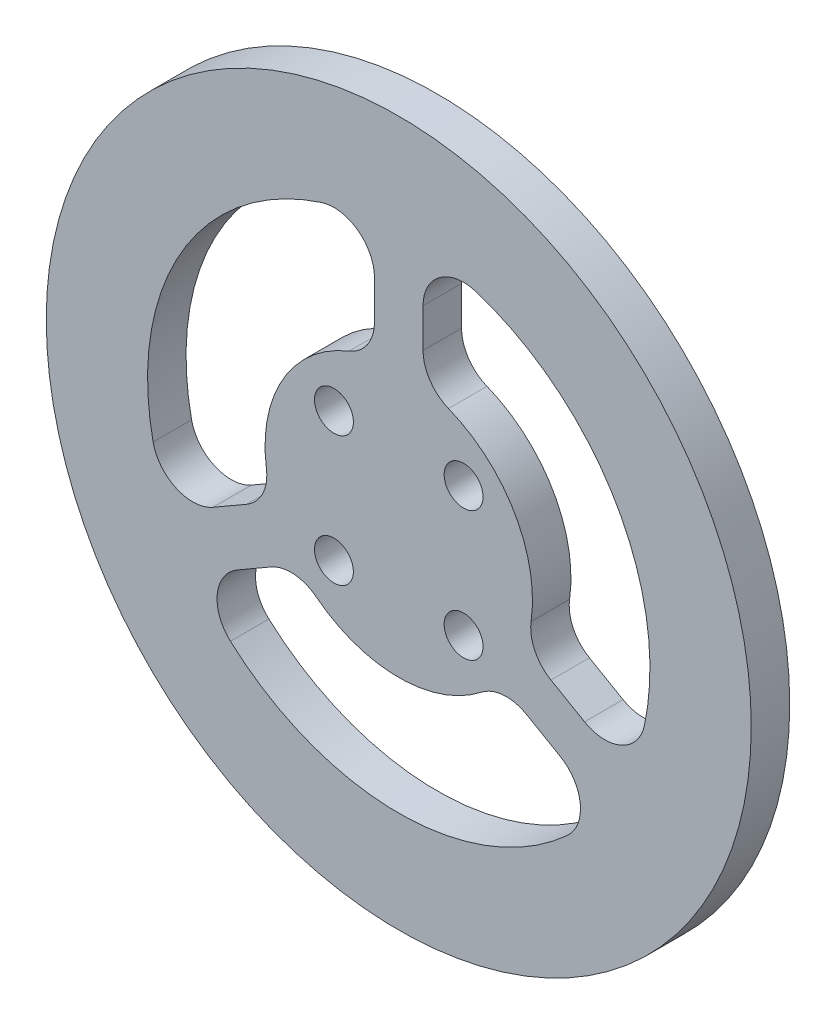
ISO-10303-21;
HEADER;
FILE_DESCRIPTION(('STEP AP214'),'2;1');
FILE_NAME('part.step','',(''),(''),'','','');
FILE_SCHEMA(('AUTOMOTIVE_DESIGN { 1 0 10303 214 1 1 1 1 }'));
ENDSEC;
DATA;
#1=APPLICATION_CONTEXT('core data for automotive mechanical design processes');
#2=APPLICATION_PROTOCOL_DEFINITION('international standard','automotive_design',2000,#1);
#3=PRODUCT_CONTEXT('',#1,'mechanical');
#4=PRODUCT('Part','Part','',(#3));
#5=PRODUCT_RELATED_PRODUCT_CATEGORY('part','',(#4));
#6=PRODUCT_DEFINITION_FORMATION('','',#4);
#7=PRODUCT_DEFINITION_CONTEXT('part definition',#1,'design');
#8=PRODUCT_DEFINITION('design','',#6,#7);
#9=PRODUCT_DEFINITION_SHAPE('','',#8);
#10=(LENGTH_UNIT() NAMED_UNIT(*) SI_UNIT(.MILLI.,.METRE.));
#11=(NAMED_UNIT(*) PLANE_ANGLE_UNIT() SI_UNIT($,.RADIAN.));
#12=(NAMED_UNIT(*) SI_UNIT($,.STERADIAN.) SOLID_ANGLE_UNIT());
#13=UNCERTAINTY_MEASURE_WITH_UNIT(LENGTH_MEASURE(1.E-05),#10,'distance_accuracy_value','');
#14=(GEOMETRIC_REPRESENTATION_CONTEXT(3) GLOBAL_UNCERTAINTY_ASSIGNED_CONTEXT((#13)) GLOBAL_UNIT_ASSIGNED_CONTEXT((#10,
#11,#12)) REPRESENTATION_CONTEXT('',''));
#15=CARTESIAN_POINT('',(0.,0.,0.));
#16=DIRECTION('',(0.,0.,1.));
#17=DIRECTION('',(1.,0.,0.));
#18=AXIS2_PLACEMENT_3D('',#15,#16,#17);
#19=CARTESIAN_POINT('',(0.,0.,-16.9802));
#20=DIRECTION('',(0.,0.,1.));
#21=DIRECTION('',(1.,0.,0.));
#22=AXIS2_PLACEMENT_3D('',#19,#20,#21);
#23=CYLINDRICAL_SURFACE('',#22,31.);
#24=CARTESIAN_POINT('',(0.,0.,0.));
#25=DIRECTION('',(0.,0.,1.));
#26=DIRECTION('',(1.,0.,0.));
#27=AXIS2_PLACEMENT_3D('',#24,#25,#26);
#28=CIRCLE('',#27,31.);
#29=CARTESIAN_POINT('',(30.3135709174803,-6.4874816555344,0.));
#30=VERTEX_POINT('',#29);
#31=CARTESIAN_POINT('',(9.53846153846153,29.4960633217263,0.));
#32=VERTEX_POINT('',#31);
#33=EDGE_CURVE('E215',#30,#32,#28,.T.);
#34=ORIENTED_EDGE('',*,*,#33,.F.);
#35=DIRECTION('',(0.,0.,1.));
#36=VECTOR('',#35,1.);
#37=CARTESIAN_POINT('',(30.3135709174803,-6.4874816555344,-16.9802));
#38=LINE('',#37,#36);
#39=CARTESIAN_POINT('',(30.3135709174803,-6.4874816555344,4.7498));
#40=VERTEX_POINT('',#39);
#41=EDGE_CURVE('E229',#30,#40,#38,.T.);
#42=ORIENTED_EDGE('',*,*,#41,.T.);
#43=CARTESIAN_POINT('',(0.,0.,4.7498));
#44=DIRECTION('',(0.,0.,1.));
#45=DIRECTION('',(1.,0.,0.));
#46=AXIS2_PLACEMENT_3D('',#43,#44,#45);
#47=CIRCLE('',#46,31.);
#48=CARTESIAN_POINT('',(9.53846153846153,29.4960633217263,4.7498));
#49=VERTEX_POINT('',#48);
#50=EDGE_CURVE('E434',#40,#49,#47,.T.);
#51=ORIENTED_EDGE('',*,*,#50,.T.);
#52=DIRECTION('',(0.,0.,1.));
#53=VECTOR('',#52,1.);
#54=CARTESIAN_POINT('',(9.53846153846153,29.4960633217263,-16.9802));
#55=LINE('',#54,#53);
#56=EDGE_CURVE('E232',#49,#32,#55,.F.);
#57=ORIENTED_EDGE('',*,*,#56,.T.);
#58=EDGE_LOOP('',(#34,#42,#51,#57));
#59=FACE_BOUND('',#58,.T.);
#60=ADVANCED_FACE('F47',(#59),#23,.F.);
#61=CARTESIAN_POINT('',(0.,0.,-16.9802));
#62=DIRECTION('',(0.,0.,1.));
#63=DIRECTION('',(1.,0.,0.));
#64=AXIS2_PLACEMENT_3D('',#61,#62,#63);
#65=CYLINDRICAL_SURFACE('',#64,16.5);
#66=CARTESIAN_POINT('',(0.,0.,0.));
#67=DIRECTION('',(0.,0.,1.));
#68=DIRECTION('',(1.,0.,0.));
#69=AXIS2_PLACEMENT_3D('',#66,#67,#68);
#70=CIRCLE('',#69,16.5);
#71=CARTESIAN_POINT('',(16.3331412041685,-2.34061923530793,0.));
#72=VERTEX_POINT('',#71);
#73=CARTESIAN_POINT('',(6.13953488372093,15.3152248240623,0.));
#74=VERTEX_POINT('',#73);
#75=EDGE_CURVE('E410',#72,#74,#70,.T.);
#76=ORIENTED_EDGE('',*,*,#75,.T.);
#77=DIRECTION('',(0.,0.,1.));
#78=VECTOR('',#77,1.);
#79=CARTESIAN_POINT('',(6.13953488372093,15.3152248240623,-16.9802));
#80=LINE('',#79,#78);
#81=CARTESIAN_POINT('',(6.13953488372093,15.3152248240623,4.7498));
#82=VERTEX_POINT('',#81);
#83=EDGE_CURVE('E265',#74,#82,#80,.T.);
#84=ORIENTED_EDGE('',*,*,#83,.T.);
#85=CARTESIAN_POINT('',(0.,0.,4.7498));
#86=DIRECTION('',(0.,0.,1.));
#87=DIRECTION('',(1.,0.,0.));
#88=AXIS2_PLACEMENT_3D('',#85,#86,#87);
#89=CIRCLE('',#88,16.5);
#90=CARTESIAN_POINT('',(16.3331412041685,-2.34061923530793,4.7498));
#91=VERTEX_POINT('',#90);
#92=EDGE_CURVE('E383',#91,#82,#89,.T.);
#93=ORIENTED_EDGE('',*,*,#92,.F.);
#94=DIRECTION('',(0.,0.,1.));
#95=VECTOR('',#94,1.);
#96=CARTESIAN_POINT('',(16.3331412041685,-2.34061923530793,-16.9802));
#97=LINE('',#96,#95);
#98=EDGE_CURVE('E262',#91,#72,#97,.F.);
#99=ORIENTED_EDGE('',*,*,#98,.T.);
#100=EDGE_LOOP('',(#76,#84,#93,#99));
#101=FACE_BOUND('',#100,.T.);
#102=ADVANCED_FACE('F466',(#101),#65,.T.);
#103=CARTESIAN_POINT('',(-20.7751093790185,-23.0085816661918,4.7498));
#104=VERTEX_POINT('',#103);
#105=CARTESIAN_POINT('',(20.7751093790189,-23.0085816661915,4.7498));
#106=VERTEX_POINT('',#105);
#107=EDGE_CURVE('E442',#104,#106,#47,.T.);
#108=ORIENTED_EDGE('',*,*,#107,.T.);
#109=DIRECTION('',(0.,0.,1.));
#110=VECTOR('',#109,1.);
#111=CARTESIAN_POINT('',(20.7751093790189,-23.0085816661915,-16.9802));
#112=LINE('',#111,#110);
#113=CARTESIAN_POINT('',(20.7751093790189,-23.0085816661915,0.));
#114=VERTEX_POINT('',#113);
#115=EDGE_CURVE('E279',#106,#114,#112,.F.);
#116=ORIENTED_EDGE('',*,*,#115,.T.);
#117=CARTESIAN_POINT('',(-20.7751093790185,-23.0085816661918,0.));
#118=VERTEX_POINT('',#117);
#119=EDGE_CURVE('E234',#118,#114,#28,.T.);
#120=ORIENTED_EDGE('',*,*,#119,.F.);
#121=DIRECTION('',(0.,0.,1.));
#122=VECTOR('',#121,1.);
#123=CARTESIAN_POINT('',(-20.7751093790185,-23.0085816661918,-16.9802));
#124=LINE('',#123,#122);
#125=EDGE_CURVE('E275',#118,#104,#124,.T.);
#126=ORIENTED_EDGE('',*,*,#125,.T.);
#127=EDGE_LOOP('',(#108,#116,#120,#126));
#128=FACE_BOUND('',#127,.T.);
#129=ADVANCED_FACE('F566',(#128),#23,.F.);
#130=CARTESIAN_POINT('',(-10.1936063204475,-12.9746055887543,0.));
#131=VERTEX_POINT('',#130);
#132=CARTESIAN_POINT('',(10.1936063204477,-12.9746055887541,0.));
#133=VERTEX_POINT('',#132);
#134=EDGE_CURVE('E416',#131,#133,#70,.T.);
#135=ORIENTED_EDGE('',*,*,#134,.T.);
#136=DIRECTION('',(0.,0.,1.));
#137=VECTOR('',#136,1.);
#138=CARTESIAN_POINT('',(10.1936063204477,-12.9746055887541,-16.9802));
#139=LINE('',#138,#137);
#140=CARTESIAN_POINT('',(10.1936063204477,-12.9746055887541,4.7498));
#141=VERTEX_POINT('',#140);
#142=EDGE_CURVE('E285',#133,#141,#139,.T.);
#143=ORIENTED_EDGE('',*,*,#142,.T.);
#144=CARTESIAN_POINT('',(-10.1936063204475,-12.9746055887543,4.7498));
#145=VERTEX_POINT('',#144);
#146=EDGE_CURVE('E385',#145,#141,#89,.T.);
#147=ORIENTED_EDGE('',*,*,#146,.F.);
#148=DIRECTION('',(0.,0.,1.));
#149=VECTOR('',#148,1.);
#150=CARTESIAN_POINT('',(-10.1936063204475,-12.9746055887543,-16.9802));
#151=LINE('',#150,#149);
#152=EDGE_CURVE('E282',#145,#131,#151,.F.);
#153=ORIENTED_EDGE('',*,*,#152,.T.);
#154=EDGE_LOOP('',(#135,#143,#147,#153));
#155=FACE_BOUND('',#154,.T.);
#156=ADVANCED_FACE('F477',(#155),#65,.T.);
#157=CARTESIAN_POINT('',(0.,0.,4.7498));
#158=DIRECTION('',(0.,0.,-1.));
#159=DIRECTION('',(-1.,0.,0.));
#160=AXIS2_PLACEMENT_3D('',#157,#158,#159);
#161=CYLINDRICAL_SURFACE('',#160,43.5);
#162=CARTESIAN_POINT('',(0.,0.,4.7498));
#163=DIRECTION('',(0.,0.,1.));
#164=DIRECTION('',(1.,0.,0.));
#165=AXIS2_PLACEMENT_3D('',#162,#163,#164);
#166=CIRCLE('',#165,43.5);
#167=CARTESIAN_POINT('',(43.5,0.,4.7498));
#168=VERTEX_POINT('',#167);
#169=EDGE_CURVE('E235',#168,#168,#166,.T.);
#170=ORIENTED_EDGE('',*,*,#169,.F.);
#171=EDGE_LOOP('',(#170));
#172=FACE_BOUND('',#171,.T.);
#173=CARTESIAN_POINT('',(0.,0.,0.));
#174=DIRECTION('',(0.,0.,1.));
#175=DIRECTION('',(1.,0.,0.));
#176=AXIS2_PLACEMENT_3D('',#173,#174,#175);
#177=CIRCLE('',#176,43.5);
#178=CARTESIAN_POINT('',(43.5,0.,0.));
#179=VERTEX_POINT('',#178);
#180=EDGE_CURVE('E430',#179,#179,#177,.T.);
#181=ORIENTED_EDGE('',*,*,#180,.T.);
#182=EDGE_LOOP('',(#181));
#183=FACE_BOUND('',#182,.T.);
#184=ADVANCED_FACE('F540',(#172,#183),#161,.T.);
#185=CARTESIAN_POINT('',(0.,0.,4.7498));
#186=DIRECTION('',(0.,0.,1.));
#187=DIRECTION('',(1.,0.,0.));
#188=AXIS2_PLACEMENT_3D('',#185,#186,#187);
#189=PLANE('',#188);
#190=CARTESIAN_POINT('',(-8.,8.,4.7498));
#191=DIRECTION('',(0.,0.,1.));
#192=DIRECTION('',(1.,0.,0.));
#193=AXIS2_PLACEMENT_3D('',#190,#191,#192);
#194=CIRCLE('',#193,2.4);
#195=CARTESIAN_POINT('',(-5.6,8.,4.7498));
#196=VERTEX_POINT('',#195);
#197=EDGE_CURVE('E531',#196,#196,#194,.T.);
#198=ORIENTED_EDGE('',*,*,#197,.F.);
#199=EDGE_LOOP('',(#198));
#200=FACE_BOUND('',#199,.T.);
#201=CARTESIAN_POINT('',(-8.,-8.,4.7498));
#202=DIRECTION('',(0.,0.,1.));
#203=DIRECTION('',(1.,0.,0.));
#204=AXIS2_PLACEMENT_3D('',#201,#202,#203);
#205=CIRCLE('',#204,2.4);
#206=CARTESIAN_POINT('',(-5.6,-8.,4.7498));
#207=VERTEX_POINT('',#206);
#208=EDGE_CURVE('E524',#207,#207,#205,.T.);
#209=ORIENTED_EDGE('',*,*,#208,.F.);
#210=EDGE_LOOP('',(#209));
#211=FACE_BOUND('',#210,.T.);
#212=CARTESIAN_POINT('',(8.,-8.,4.7498));
#213=DIRECTION('',(0.,0.,1.));
#214=DIRECTION('',(1.,0.,0.));
#215=AXIS2_PLACEMENT_3D('',#212,#213,#214);
#216=CIRCLE('',#215,2.4);
#217=CARTESIAN_POINT('',(10.4,-8.,4.7498));
#218=VERTEX_POINT('',#217);
#219=EDGE_CURVE('E517',#218,#218,#216,.T.);
#220=ORIENTED_EDGE('',*,*,#219,.F.);
#221=EDGE_LOOP('',(#220));
#222=FACE_BOUND('',#221,.T.);
#223=CARTESIAN_POINT('',(8.,8.,4.7498));
#224=DIRECTION('',(0.,0.,1.));
#225=DIRECTION('',(1.,0.,0.));
#226=AXIS2_PLACEMENT_3D('',#223,#224,#225);
#227=CIRCLE('',#226,2.4);
#228=CARTESIAN_POINT('',(10.4,8.,4.7498));
#229=VERTEX_POINT('',#228);
#230=EDGE_CURVE('E505',#229,#229,#227,.T.);
#231=ORIENTED_EDGE('',*,*,#230,.F.);
#232=EDGE_LOOP('',(#231));
#233=FACE_BOUND('',#232,.T.);
#234=DIRECTION('',(0.866025403784436,0.500000000000004,0.));
#235=VECTOR('',#234,1.);
#236=CARTESIAN_POINT('',(-12.5512454963963,-10.7105665811474,4.7498));
#237=LINE('',#236,#235);
#238=CARTESIAN_POINT('',(-19.9242852856285,-14.9673930882064,4.7498));
#239=VERTEX_POINT('',#238);
#240=CARTESIAN_POINT('',(-15.7825779327043,-12.5761772330909,4.7498));
#241=VERTEX_POINT('',#240);
#242=EDGE_CURVE('E392',#239,#241,#237,.T.);
#243=ORIENTED_EDGE('',*,*,#242,.T.);
#244=CARTESIAN_POINT('',(-13.2825779327043,-16.9063042520131,4.7498));
#245=DIRECTION('',(0.,0.,1.));
#246=DIRECTION('',(1.,0.,0.));
#247=AXIS2_PLACEMENT_3D('',#244,#245,#246);
#248=CIRCLE('',#247,5.);
#249=EDGE_CURVE('E354',#241,#145,#248,.F.);
#250=ORIENTED_EDGE('',*,*,#249,.T.);
#251=ORIENTED_EDGE('',*,*,#146,.T.);
#252=CARTESIAN_POINT('',(13.2825779327045,-16.9063042520129,4.7498));
#253=DIRECTION('',(0.,0.,1.));
#254=DIRECTION('',(1.,0.,0.));
#255=AXIS2_PLACEMENT_3D('',#252,#253,#254);
#256=CIRCLE('',#255,5.);
#257=CARTESIAN_POINT('',(15.7825779327045,-12.5761772330907,4.7498));
#258=VERTEX_POINT('',#257);
#259=EDGE_CURVE('E348',#141,#258,#256,.F.);
#260=ORIENTED_EDGE('',*,*,#259,.T.);
#261=DIRECTION('',(0.866025403784443,-0.499999999999992,0.));
#262=VECTOR('',#261,1.);
#263=CARTESIAN_POINT('',(12.5512454963965,-10.7105665811472,4.7498));
#264=LINE('',#263,#262);
#265=CARTESIAN_POINT('',(19.9242852856287,-14.9673930882061,4.7498));
#266=VERTEX_POINT('',#265);
#267=EDGE_CURVE('E491',#258,#266,#264,.T.);
#268=ORIENTED_EDGE('',*,*,#267,.T.);
#269=CARTESIAN_POINT('',(17.4242852856287,-19.2975201071283,4.7498));
#270=DIRECTION('',(0.,0.,1.));
#271=DIRECTION('',(1.,0.,0.));
#272=AXIS2_PLACEMENT_3D('',#269,#270,#271);
#273=CIRCLE('',#272,5.);
#274=EDGE_CURVE('E342',#266,#106,#273,.F.);
#275=ORIENTED_EDGE('',*,*,#274,.T.);
#276=ORIENTED_EDGE('',*,*,#107,.F.);
#277=CARTESIAN_POINT('',(-17.4242852856285,-19.2975201071286,4.7498));
#278=DIRECTION('',(0.,0.,1.));
#279=DIRECTION('',(1.,0.,0.));
#280=AXIS2_PLACEMENT_3D('',#277,#278,#279);
#281=CIRCLE('',#280,5.);
#282=EDGE_CURVE('E360',#104,#239,#281,.F.);
#283=ORIENTED_EDGE('',*,*,#282,.T.);
#284=EDGE_LOOP('',(#243,#250,#251,#260,#268,#275,#276,#283));
#285=FACE_BOUND('',#284,.T.);
#286=ORIENTED_EDGE('',*,*,#50,.F.);
#287=CARTESIAN_POINT('',(25.4242852856286,-5.44111364657724,4.7498));
#288=DIRECTION('',(0.,0.,1.));
#289=DIRECTION('',(1.,0.,0.));
#290=AXIS2_PLACEMENT_3D('',#287,#288,#289);
#291=CIRCLE('',#290,5.);
#292=CARTESIAN_POINT('',(22.9242852856286,-9.77124066549945,4.7498));
#293=VERTEX_POINT('',#292);
#294=EDGE_CURVE('E224',#40,#293,#291,.F.);
#295=ORIENTED_EDGE('',*,*,#294,.T.);
#296=DIRECTION('',(-0.866025403784443,0.499999999999992,0.));
#297=VECTOR('',#296,1.);
#298=CARTESIAN_POINT('',(15.5512454963964,-5.51441415844052,4.7498));
#299=LINE('',#298,#297);
#300=CARTESIAN_POINT('',(18.7825779327044,-7.38002481038406,4.7498));
#301=VERTEX_POINT('',#300);
#302=EDGE_CURVE('E497',#293,#301,#299,.T.);
#303=ORIENTED_EDGE('',*,*,#302,.T.);
#304=CARTESIAN_POINT('',(21.2825779327044,-3.04989779146185,4.7498));
#305=DIRECTION('',(0.,0.,1.));
#306=DIRECTION('',(1.,0.,0.));
#307=AXIS2_PLACEMENT_3D('',#304,#305,#306);
#308=CIRCLE('',#307,5.);
#309=EDGE_CURVE('E336',#301,#91,#308,.F.);
#310=ORIENTED_EDGE('',*,*,#309,.T.);
#311=ORIENTED_EDGE('',*,*,#92,.T.);
#312=CARTESIAN_POINT('',(8.,19.9562020434751,4.7498));
#313=DIRECTION('',(0.,0.,1.));
#314=DIRECTION('',(1.,0.,0.));
#315=AXIS2_PLACEMENT_3D('',#312,#313,#314);
#316=CIRCLE('',#315,5.);
#317=CARTESIAN_POINT('',(3.,19.9562020434751,4.7498));
#318=VERTEX_POINT('',#317);
#319=EDGE_CURVE('E330',#82,#318,#316,.F.);
#320=ORIENTED_EDGE('',*,*,#319,.T.);
#321=DIRECTION('',(0.,1.,0.));
#322=VECTOR('',#321,1.);
#323=CARTESIAN_POINT('',(3.,16.2249807395879,4.7498));
#324=LINE('',#323,#322);
#325=CARTESIAN_POINT('',(3.,24.738633753706,4.7498));
#326=VERTEX_POINT('',#325);
#327=EDGE_CURVE('E415',#318,#326,#324,.T.);
#328=ORIENTED_EDGE('',*,*,#327,.T.);
#329=CARTESIAN_POINT('',(8.,24.738633753706,4.7498));
#330=DIRECTION('',(0.,0.,1.));
#331=DIRECTION('',(1.,0.,0.));
#332=AXIS2_PLACEMENT_3D('',#329,#330,#331);
#333=CIRCLE('',#332,5.);
#334=EDGE_CURVE('E223',#326,#49,#333,.F.);
#335=ORIENTED_EDGE('',*,*,#334,.T.);
#336=EDGE_LOOP('',(#286,#295,#303,#310,#311,#320,#328,#335));
#337=FACE_BOUND('',#336,.T.);
#338=CARTESIAN_POINT('',(-9.53846153846153,29.4960633217263,4.7498));
#339=VERTEX_POINT('',#338);
#340=CARTESIAN_POINT('',(-30.3135709174802,-6.48748165553482,4.7498));
#341=VERTEX_POINT('',#340);
#342=EDGE_CURVE('E249',#339,#341,#47,.T.);
#343=ORIENTED_EDGE('',*,*,#342,.F.);
#344=CARTESIAN_POINT('',(-7.99999999999999,24.738633753706,4.7498));
#345=DIRECTION('',(0.,0.,1.));
#346=DIRECTION('',(1.,0.,0.));
#347=AXIS2_PLACEMENT_3D('',#344,#345,#346);
#348=CIRCLE('',#347,5.);
#349=CARTESIAN_POINT('',(-3.,24.738633753706,4.7498));
#350=VERTEX_POINT('',#349);
#351=EDGE_CURVE('E56',#339,#350,#348,.F.);
#352=ORIENTED_EDGE('',*,*,#351,.T.);
#353=DIRECTION('',(0.,-1.,0.));
#354=VECTOR('',#353,1.);
#355=CARTESIAN_POINT('',(-3.,16.2249807395879,4.7498));
#356=LINE('',#355,#354);
#357=CARTESIAN_POINT('',(-3.,19.9562020434751,4.7498));
#358=VERTEX_POINT('',#357);
#359=EDGE_CURVE('E422',#350,#358,#356,.T.);
#360=ORIENTED_EDGE('',*,*,#359,.T.);
#361=CARTESIAN_POINT('',(-7.99999999999999,19.9562020434751,4.7498));
#362=DIRECTION('',(0.,0.,1.));
#363=DIRECTION('',(1.,0.,0.));
#364=AXIS2_PLACEMENT_3D('',#361,#362,#363);
#365=CIRCLE('',#364,5.);
#366=CARTESIAN_POINT('',(-6.13953488372093,15.3152248240623,4.7498));
#367=VERTEX_POINT('',#366);
#368=EDGE_CURVE('E63',#358,#367,#365,.F.);
#369=ORIENTED_EDGE('',*,*,#368,.T.);
#370=CARTESIAN_POINT('',(-16.3331412041685,-2.34061923530816,4.7498));
#371=VERTEX_POINT('',#370);
#372=EDGE_CURVE('E388',#367,#371,#89,.T.);
#373=ORIENTED_EDGE('',*,*,#372,.T.);
#374=CARTESIAN_POINT('',(-21.2825779327044,-3.04989779146214,4.7498));
#375=DIRECTION('',(0.,0.,1.));
#376=DIRECTION('',(1.,0.,0.));
#377=AXIS2_PLACEMENT_3D('',#374,#375,#376);
#378=CIRCLE('',#377,5.);
#379=CARTESIAN_POINT('',(-18.7825779327043,-7.38002481038433,4.7498));
#380=VERTEX_POINT('',#379);
#381=EDGE_CURVE('E371',#371,#380,#378,.F.);
#382=ORIENTED_EDGE('',*,*,#381,.T.);
#383=DIRECTION('',(-0.866025403784436,-0.500000000000004,0.));
#384=VECTOR('',#383,1.);
#385=CARTESIAN_POINT('',(-15.5512454963964,-5.51441415844073,4.7498));
#386=LINE('',#385,#384);
#387=CARTESIAN_POINT('',(-22.9242852856285,-9.77124066549977,4.7498));
#388=VERTEX_POINT('',#387);
#389=EDGE_CURVE('E390',#380,#388,#386,.T.);
#390=ORIENTED_EDGE('',*,*,#389,.T.);
#391=CARTESIAN_POINT('',(-25.4242852856285,-5.44111364657759,4.7498));
#392=DIRECTION('',(0.,0.,1.));
#393=DIRECTION('',(1.,0.,0.));
#394=AXIS2_PLACEMENT_3D('',#391,#392,#393);
#395=CIRCLE('',#394,5.);
#396=EDGE_CURVE('E366',#388,#341,#395,.F.);
#397=ORIENTED_EDGE('',*,*,#396,.T.);
#398=EDGE_LOOP('',(#343,#352,#360,#369,#373,#382,#390,#397));
#399=FACE_BOUND('',#398,.T.);
#400=ORIENTED_EDGE('',*,*,#169,.T.);
#401=EDGE_LOOP('',(#400));
#402=FACE_BOUND('',#401,.T.);
#403=ADVANCED_FACE('F490',(#200,#211,#222,#233,#285,#337,#399,#402),#189,.T.);
#404=CARTESIAN_POINT('',(0.,0.,0.));
#405=DIRECTION('',(0.,0.,1.));
#406=DIRECTION('',(1.,0.,0.));
#407=AXIS2_PLACEMENT_3D('',#404,#405,#406);
#408=PLANE('',#407);
#409=CARTESIAN_POINT('',(-8.,8.,0.));
#410=DIRECTION('',(0.,0.,1.));
#411=DIRECTION('',(1.,0.,0.));
#412=AXIS2_PLACEMENT_3D('',#409,#410,#411);
#413=CIRCLE('',#412,2.4);
#414=CARTESIAN_POINT('',(-5.6,8.,0.));
#415=VERTEX_POINT('',#414);
#416=EDGE_CURVE('E527',#415,#415,#413,.T.);
#417=ORIENTED_EDGE('',*,*,#416,.T.);
#418=EDGE_LOOP('',(#417));
#419=FACE_BOUND('',#418,.T.);
#420=CARTESIAN_POINT('',(-8.,-8.,0.));
#421=DIRECTION('',(0.,0.,1.));
#422=DIRECTION('',(1.,0.,0.));
#423=AXIS2_PLACEMENT_3D('',#420,#421,#422);
#424=CIRCLE('',#423,2.4);
#425=CARTESIAN_POINT('',(-5.6,-8.,0.));
#426=VERTEX_POINT('',#425);
#427=EDGE_CURVE('E520',#426,#426,#424,.T.);
#428=ORIENTED_EDGE('',*,*,#427,.T.);
#429=EDGE_LOOP('',(#428));
#430=FACE_BOUND('',#429,.T.);
#431=CARTESIAN_POINT('',(8.,-8.,0.));
#432=DIRECTION('',(0.,0.,1.));
#433=DIRECTION('',(1.,0.,0.));
#434=AXIS2_PLACEMENT_3D('',#431,#432,#433);
#435=CIRCLE('',#434,2.4);
#436=CARTESIAN_POINT('',(10.4,-8.,0.));
#437=VERTEX_POINT('',#436);
#438=EDGE_CURVE('E513',#437,#437,#435,.T.);
#439=ORIENTED_EDGE('',*,*,#438,.T.);
#440=EDGE_LOOP('',(#439));
#441=FACE_BOUND('',#440,.T.);
#442=CARTESIAN_POINT('',(8.,8.,0.));
#443=DIRECTION('',(0.,0.,1.));
#444=DIRECTION('',(1.,0.,0.));
#445=AXIS2_PLACEMENT_3D('',#442,#443,#444);
#446=CIRCLE('',#445,2.4);
#447=CARTESIAN_POINT('',(10.4,8.,0.));
#448=VERTEX_POINT('',#447);
#449=EDGE_CURVE('E498',#448,#448,#446,.T.);
#450=ORIENTED_EDGE('',*,*,#449,.T.);
#451=EDGE_LOOP('',(#450));
#452=FACE_BOUND('',#451,.T.);
#453=ORIENTED_EDGE('',*,*,#75,.F.);
#454=CARTESIAN_POINT('',(21.2825779327044,-3.04989779146185,0.));
#455=DIRECTION('',(0.,0.,1.));
#456=DIRECTION('',(1.,0.,0.));
#457=AXIS2_PLACEMENT_3D('',#454,#455,#456);
#458=CIRCLE('',#457,5.);
#459=CARTESIAN_POINT('',(18.7825779327044,-7.38002481038406,0.));
#460=VERTEX_POINT('',#459);
#461=EDGE_CURVE('E339',#72,#460,#458,.T.);
#462=ORIENTED_EDGE('',*,*,#461,.T.);
#463=DIRECTION('',(0.866025403784443,-0.499999999999992,0.));
#464=VECTOR('',#463,1.);
#465=CARTESIAN_POINT('',(15.5512454963964,-5.51441415844052,0.));
#466=LINE('',#465,#464);
#467=CARTESIAN_POINT('',(22.9242852856286,-9.77124066549946,0.));
#468=VERTEX_POINT('',#467);
#469=EDGE_CURVE('E218',#460,#468,#466,.T.);
#470=ORIENTED_EDGE('',*,*,#469,.T.);
#471=CARTESIAN_POINT('',(25.4242852856286,-5.44111364657724,0.));
#472=DIRECTION('',(0.,0.,1.));
#473=DIRECTION('',(1.,0.,0.));
#474=AXIS2_PLACEMENT_3D('',#471,#472,#473);
#475=CIRCLE('',#474,5.);
#476=EDGE_CURVE('E210',#468,#30,#475,.T.);
#477=ORIENTED_EDGE('',*,*,#476,.T.);
#478=ORIENTED_EDGE('',*,*,#33,.T.);
#479=CARTESIAN_POINT('',(8.,24.738633753706,0.));
#480=DIRECTION('',(0.,0.,1.));
#481=DIRECTION('',(1.,0.,0.));
#482=AXIS2_PLACEMENT_3D('',#479,#480,#481);
#483=CIRCLE('',#482,5.);
#484=CARTESIAN_POINT('',(3.,24.738633753706,0.));
#485=VERTEX_POINT('',#484);
#486=EDGE_CURVE('E327',#32,#485,#483,.T.);
#487=ORIENTED_EDGE('',*,*,#486,.T.);
#488=DIRECTION('',(0.,-1.,0.));
#489=VECTOR('',#488,1.);
#490=CARTESIAN_POINT('',(3.,16.2249807395879,0.));
#491=LINE('',#490,#489);
#492=CARTESIAN_POINT('',(3.,19.9562020434751,0.));
#493=VERTEX_POINT('',#492);
#494=EDGE_CURVE('E421',#485,#493,#491,.T.);
#495=ORIENTED_EDGE('',*,*,#494,.T.);
#496=CARTESIAN_POINT('',(8.,19.9562020434751,0.));
#497=DIRECTION('',(0.,0.,1.));
#498=DIRECTION('',(1.,0.,0.));
#499=AXIS2_PLACEMENT_3D('',#496,#497,#498);
#500=CIRCLE('',#499,5.);
#501=EDGE_CURVE('E333',#493,#74,#500,.T.);
#502=ORIENTED_EDGE('',*,*,#501,.T.);
#503=EDGE_LOOP('',(#453,#462,#470,#477,#478,#487,#495,#502));
#504=FACE_BOUND('',#503,.T.);
#505=DIRECTION('',(0.,1.,0.));
#506=VECTOR('',#505,1.);
#507=CARTESIAN_POINT('',(-3.,16.2249807395879,0.));
#508=LINE('',#507,#506);
#509=CARTESIAN_POINT('',(-3.,19.9562020434751,0.));
#510=VERTEX_POINT('',#509);
#511=CARTESIAN_POINT('',(-3.,24.738633753706,0.));
#512=VERTEX_POINT('',#511);
#513=EDGE_CURVE('E417',#510,#512,#508,.T.);
#514=ORIENTED_EDGE('',*,*,#513,.T.);
#515=CARTESIAN_POINT('',(-7.99999999999999,24.738633753706,0.));
#516=DIRECTION('',(0.,0.,1.));
#517=DIRECTION('',(1.,0.,0.));
#518=AXIS2_PLACEMENT_3D('',#515,#516,#517);
#519=CIRCLE('',#518,5.);
#520=CARTESIAN_POINT('',(-9.53846153846153,29.4960633217263,0.));
#521=VERTEX_POINT('',#520);
#522=EDGE_CURVE('E11',#512,#521,#519,.T.);
#523=ORIENTED_EDGE('',*,*,#522,.T.);
#524=CARTESIAN_POINT('',(-30.3135709174802,-6.48748165553482,0.));
#525=VERTEX_POINT('',#524);
#526=EDGE_CURVE('E237',#521,#525,#28,.T.);
#527=ORIENTED_EDGE('',*,*,#526,.T.);
#528=CARTESIAN_POINT('',(-25.4242852856285,-5.44111364657759,0.));
#529=DIRECTION('',(0.,0.,1.));
#530=DIRECTION('',(1.,0.,0.));
#531=AXIS2_PLACEMENT_3D('',#528,#529,#530);
#532=CIRCLE('',#531,5.);
#533=CARTESIAN_POINT('',(-22.9242852856285,-9.77124066549977,0.));
#534=VERTEX_POINT('',#533);
#535=EDGE_CURVE('E369',#525,#534,#532,.T.);
#536=ORIENTED_EDGE('',*,*,#535,.T.);
#537=DIRECTION('',(0.866025403784436,0.500000000000004,0.));
#538=VECTOR('',#537,1.);
#539=CARTESIAN_POINT('',(-15.5512454963964,-5.51441415844073,0.));
#540=LINE('',#539,#538);
#541=CARTESIAN_POINT('',(-18.7825779327043,-7.38002481038433,0.));
#542=VERTEX_POINT('',#541);
#543=EDGE_CURVE('E386',#534,#542,#540,.T.);
#544=ORIENTED_EDGE('',*,*,#543,.T.);
#545=CARTESIAN_POINT('',(-21.2825779327044,-3.04989779146214,0.));
#546=DIRECTION('',(0.,0.,1.));
#547=DIRECTION('',(1.,0.,0.));
#548=AXIS2_PLACEMENT_3D('',#545,#546,#547);
#549=CIRCLE('',#548,5.);
#550=CARTESIAN_POINT('',(-16.3331412041685,-2.34061923530816,0.));
#551=VERTEX_POINT('',#550);
#552=EDGE_CURVE('E374',#542,#551,#549,.T.);
#553=ORIENTED_EDGE('',*,*,#552,.T.);
#554=CARTESIAN_POINT('',(-6.13953488372093,15.3152248240623,0.));
#555=VERTEX_POINT('',#554);
#556=EDGE_CURVE('E411',#555,#551,#70,.T.);
#557=ORIENTED_EDGE('',*,*,#556,.F.);
#558=CARTESIAN_POINT('',(-7.99999999999999,19.9562020434751,0.));
#559=DIRECTION('',(0.,0.,1.));
#560=DIRECTION('',(1.,0.,0.));
#561=AXIS2_PLACEMENT_3D('',#558,#559,#560);
#562=CIRCLE('',#561,5.);
#563=EDGE_CURVE('E379',#555,#510,#562,.T.);
#564=ORIENTED_EDGE('',*,*,#563,.T.);
#565=EDGE_LOOP('',(#514,#523,#527,#536,#544,#553,#557,#564));
#566=FACE_BOUND('',#565,.T.);
#567=ORIENTED_EDGE('',*,*,#134,.F.);
#568=CARTESIAN_POINT('',(-13.2825779327043,-16.9063042520131,0.));
#569=DIRECTION('',(0.,0.,1.));
#570=DIRECTION('',(1.,0.,0.));
#571=AXIS2_PLACEMENT_3D('',#568,#569,#570);
#572=CIRCLE('',#571,5.);
#573=CARTESIAN_POINT('',(-15.7825779327043,-12.5761772330909,0.));
#574=VERTEX_POINT('',#573);
#575=EDGE_CURVE('E357',#131,#574,#572,.T.);
#576=ORIENTED_EDGE('',*,*,#575,.T.);
#577=DIRECTION('',(-0.866025403784436,-0.500000000000004,0.));
#578=VECTOR('',#577,1.);
#579=CARTESIAN_POINT('',(-12.5512454963963,-10.7105665811474,0.));
#580=LINE('',#579,#578);
#581=CARTESIAN_POINT('',(-19.9242852856285,-14.9673930882064,0.));
#582=VERTEX_POINT('',#581);
#583=EDGE_CURVE('E398',#574,#582,#580,.T.);
#584=ORIENTED_EDGE('',*,*,#583,.T.);
#585=CARTESIAN_POINT('',(-17.4242852856285,-19.2975201071286,0.));
#586=DIRECTION('',(0.,0.,1.));
#587=DIRECTION('',(1.,0.,0.));
#588=AXIS2_PLACEMENT_3D('',#585,#586,#587);
#589=CIRCLE('',#588,5.);
#590=EDGE_CURVE('E363',#582,#118,#589,.T.);
#591=ORIENTED_EDGE('',*,*,#590,.T.);
#592=ORIENTED_EDGE('',*,*,#119,.T.);
#593=CARTESIAN_POINT('',(17.4242852856287,-19.2975201071283,0.));
#594=DIRECTION('',(0.,0.,1.));
#595=DIRECTION('',(1.,0.,0.));
#596=AXIS2_PLACEMENT_3D('',#593,#594,#595);
#597=CIRCLE('',#596,5.);
#598=CARTESIAN_POINT('',(19.9242852856287,-14.9673930882061,0.));
#599=VERTEX_POINT('',#598);
#600=EDGE_CURVE('E345',#114,#599,#597,.T.);
#601=ORIENTED_EDGE('',*,*,#600,.T.);
#602=DIRECTION('',(-0.866025403784443,0.499999999999992,0.));
#603=VECTOR('',#602,1.);
#604=CARTESIAN_POINT('',(12.5512454963965,-10.7105665811472,0.));
#605=LINE('',#604,#603);
#606=CARTESIAN_POINT('',(15.7825779327045,-12.5761772330907,0.));
#607=VERTEX_POINT('',#606);
#608=EDGE_CURVE('E393',#599,#607,#605,.T.);
#609=ORIENTED_EDGE('',*,*,#608,.T.);
#610=CARTESIAN_POINT('',(13.2825779327045,-16.9063042520129,0.));
#611=DIRECTION('',(0.,0.,1.));
#612=DIRECTION('',(1.,0.,0.));
#613=AXIS2_PLACEMENT_3D('',#610,#611,#612);
#614=CIRCLE('',#613,5.);
#615=EDGE_CURVE('E351',#607,#133,#614,.T.);
#616=ORIENTED_EDGE('',*,*,#615,.T.);
#617=EDGE_LOOP('',(#567,#576,#584,#591,#592,#601,#609,#616));
#618=FACE_BOUND('',#617,.T.);
#619=ORIENTED_EDGE('',*,*,#180,.F.);
#620=EDGE_LOOP('',(#619));
#621=FACE_BOUND('',#620,.T.);
#622=ADVANCED_FACE('F213',(#419,#430,#441,#452,#504,#566,#618,#621),#408,.F.);
#623=ORIENTED_EDGE('',*,*,#342,.T.);
#624=DIRECTION('',(0.,0.,1.));
#625=VECTOR('',#624,1.);
#626=CARTESIAN_POINT('',(-30.3135709174802,-6.48748165553482,-16.9802));
#627=LINE('',#626,#625);
#628=EDGE_CURVE('E307',#341,#525,#627,.F.);
#629=ORIENTED_EDGE('',*,*,#628,.T.);
#630=ORIENTED_EDGE('',*,*,#526,.F.);
#631=DIRECTION('',(0.,0.,1.));
#632=VECTOR('',#631,1.);
#633=CARTESIAN_POINT('',(-9.53846153846153,29.4960633217263,-16.9802));
#634=LINE('',#633,#632);
#635=EDGE_CURVE('E303',#521,#339,#634,.T.);
#636=ORIENTED_EDGE('',*,*,#635,.T.);
#637=EDGE_LOOP('',(#623,#629,#630,#636));
#638=FACE_BOUND('',#637,.T.);
#639=ADVANCED_FACE('F567',(#638),#23,.F.);
#640=CARTESIAN_POINT('',(-3.,16.2249807395879,-15.9468239516697));
#641=DIRECTION('',(-1.,0.,0.));
#642=DIRECTION('',(0.,-1.,0.));
#643=AXIS2_PLACEMENT_3D('',#640,#641,#642);
#644=PLANE('',#643);
#645=ORIENTED_EDGE('',*,*,#513,.F.);
#646=DIRECTION('',(0.,0.,-1.));
#647=VECTOR('',#646,1.);
#648=CARTESIAN_POINT('',(-3.,19.9562020434751,4.7498));
#649=LINE('',#648,#647);
#650=EDGE_CURVE('E320',#510,#358,#649,.F.);
#651=ORIENTED_EDGE('',*,*,#650,.T.);
#652=ORIENTED_EDGE('',*,*,#359,.F.);
#653=DIRECTION('',(0.,0.,1.));
#654=VECTOR('',#653,1.);
#655=CARTESIAN_POINT('',(-3.,24.738633753706,-15.9468239516697));
#656=LINE('',#655,#654);
#657=EDGE_CURVE('E317',#350,#512,#656,.F.);
#658=ORIENTED_EDGE('',*,*,#657,.T.);
#659=EDGE_LOOP('',(#645,#651,#652,#658));
#660=FACE_BOUND('',#659,.T.);
#661=ADVANCED_FACE('F578',(#660),#644,.T.);
#662=CARTESIAN_POINT('',(3.,16.2249807395879,-15.9468239516697));
#663=DIRECTION('',(1.,0.,0.));
#664=DIRECTION('',(0.,1.,0.));
#665=AXIS2_PLACEMENT_3D('',#662,#663,#664);
#666=PLANE('',#665);
#667=ORIENTED_EDGE('',*,*,#494,.F.);
#668=DIRECTION('',(0.,0.,1.));
#669=VECTOR('',#668,1.);
#670=CARTESIAN_POINT('',(3.,24.738633753706,-15.9468239516697));
#671=LINE('',#670,#669);
#672=EDGE_CURVE('E258',#485,#326,#671,.T.);
#673=ORIENTED_EDGE('',*,*,#672,.T.);
#674=ORIENTED_EDGE('',*,*,#327,.F.);
#675=DIRECTION('',(0.,0.,-1.));
#676=VECTOR('',#675,1.);
#677=CARTESIAN_POINT('',(3.,19.9562020434751,0.));
#678=LINE('',#677,#676);
#679=EDGE_CURVE('E255',#318,#493,#678,.T.);
#680=ORIENTED_EDGE('',*,*,#679,.T.);
#681=EDGE_LOOP('',(#667,#673,#674,#680));
#682=FACE_BOUND('',#681,.T.);
#683=ADVANCED_FACE('F457',(#682),#666,.T.);
#684=ORIENTED_EDGE('',*,*,#556,.T.);
#685=DIRECTION('',(0.,0.,1.));
#686=VECTOR('',#685,1.);
#687=CARTESIAN_POINT('',(-16.3331412041685,-2.34061923530815,-16.9802));
#688=LINE('',#687,#686);
#689=EDGE_CURVE('E313',#551,#371,#688,.T.);
#690=ORIENTED_EDGE('',*,*,#689,.T.);
#691=ORIENTED_EDGE('',*,*,#372,.F.);
#692=DIRECTION('',(0.,0.,1.));
#693=VECTOR('',#692,1.);
#694=CARTESIAN_POINT('',(-6.13953488372093,15.3152248240623,-16.9802));
#695=LINE('',#694,#693);
#696=EDGE_CURVE('E310',#367,#555,#695,.F.);
#697=ORIENTED_EDGE('',*,*,#696,.T.);
#698=EDGE_LOOP('',(#684,#690,#691,#697));
#699=FACE_BOUND('',#698,.T.);
#700=ADVANCED_FACE('F572',(#699),#65,.T.);
#701=CARTESIAN_POINT('',(-12.5512454963963,-10.7105665811474,-20.051362753989));
#702=DIRECTION('',(0.500000000000004,-0.866025403784436,0.));
#703=DIRECTION('',(0.866025403784436,0.500000000000004,0.));
#704=AXIS2_PLACEMENT_3D('',#701,#702,#703);
#705=PLANE('',#704);
#706=ORIENTED_EDGE('',*,*,#583,.F.);
#707=DIRECTION('',(0.,0.,-1.));
#708=VECTOR('',#707,1.);
#709=CARTESIAN_POINT('',(-15.7825779327043,-12.5761772330909,4.7498));
#710=LINE('',#709,#708);
#711=EDGE_CURVE('E292',#574,#241,#710,.F.);
#712=ORIENTED_EDGE('',*,*,#711,.T.);
#713=ORIENTED_EDGE('',*,*,#242,.F.);
#714=DIRECTION('',(0.,0.,1.));
#715=VECTOR('',#714,1.);
#716=CARTESIAN_POINT('',(-19.9242852856285,-14.9673930882064,-20.051362753989));
#717=LINE('',#716,#715);
#718=EDGE_CURVE('E289',#239,#582,#717,.F.);
#719=ORIENTED_EDGE('',*,*,#718,.T.);
#720=EDGE_LOOP('',(#706,#712,#713,#719));
#721=FACE_BOUND('',#720,.T.);
#722=ADVANCED_FACE('F655',(#721),#705,.T.);
#723=CARTESIAN_POINT('',(-15.5512454963964,-5.51441415844073,-20.051362753989));
#724=DIRECTION('',(-0.500000000000004,0.866025403784436,0.));
#725=DIRECTION('',(-0.866025403784436,-0.500000000000004,0.));
#726=AXIS2_PLACEMENT_3D('',#723,#724,#725);
#727=PLANE('',#726);
#728=ORIENTED_EDGE('',*,*,#543,.F.);
#729=DIRECTION('',(0.,0.,1.));
#730=VECTOR('',#729,1.);
#731=CARTESIAN_POINT('',(-22.9242852856285,-9.77124066549977,-20.051362753989));
#732=LINE('',#731,#730);
#733=EDGE_CURVE('E299',#534,#388,#732,.T.);
#734=ORIENTED_EDGE('',*,*,#733,.T.);
#735=ORIENTED_EDGE('',*,*,#389,.F.);
#736=DIRECTION('',(0.,0.,-1.));
#737=VECTOR('',#736,1.);
#738=CARTESIAN_POINT('',(-18.7825779327043,-7.38002481038433,0.));
#739=LINE('',#738,#737);
#740=EDGE_CURVE('E296',#380,#542,#739,.T.);
#741=ORIENTED_EDGE('',*,*,#740,.T.);
#742=EDGE_LOOP('',(#728,#734,#735,#741));
#743=FACE_BOUND('',#742,.T.);
#744=ADVANCED_FACE('F636',(#743),#727,.T.);
#745=CARTESIAN_POINT('',(15.5512454963964,-5.51441415844052,-20.051362753989));
#746=DIRECTION('',(0.499999999999992,0.866025403784443,0.));
#747=DIRECTION('',(-0.866025403784443,0.499999999999992,0.));
#748=AXIS2_PLACEMENT_3D('',#745,#746,#747);
#749=PLANE('',#748);
#750=ORIENTED_EDGE('',*,*,#302,.F.);
#751=DIRECTION('',(0.,0.,1.));
#752=VECTOR('',#751,1.);
#753=CARTESIAN_POINT('',(22.9242852856286,-9.77124066549945,-20.051362753989));
#754=LINE('',#753,#752);
#755=EDGE_CURVE('E246',#293,#468,#754,.F.);
#756=ORIENTED_EDGE('',*,*,#755,.T.);
#757=ORIENTED_EDGE('',*,*,#469,.F.);
#758=DIRECTION('',(0.,0.,-1.));
#759=VECTOR('',#758,1.);
#760=CARTESIAN_POINT('',(18.7825779327044,-7.38002481038406,4.7498));
#761=LINE('',#760,#759);
#762=EDGE_CURVE('E240',#460,#301,#761,.F.);
#763=ORIENTED_EDGE('',*,*,#762,.T.);
#764=EDGE_LOOP('',(#750,#756,#757,#763));
#765=FACE_BOUND('',#764,.T.);
#766=ADVANCED_FACE('F658',(#765),#749,.T.);
#767=CARTESIAN_POINT('',(12.5512454963965,-10.7105665811472,-20.051362753989));
#768=DIRECTION('',(-0.499999999999992,-0.866025403784443,0.));
#769=DIRECTION('',(0.866025403784443,-0.499999999999992,0.));
#770=AXIS2_PLACEMENT_3D('',#767,#768,#769);
#771=PLANE('',#770);
#772=ORIENTED_EDGE('',*,*,#608,.F.);
#773=DIRECTION('',(0.,0.,1.));
#774=VECTOR('',#773,1.);
#775=CARTESIAN_POINT('',(19.9242852856287,-14.9673930882061,-20.051362753989));
#776=LINE('',#775,#774);
#777=EDGE_CURVE('E272',#599,#266,#776,.T.);
#778=ORIENTED_EDGE('',*,*,#777,.T.);
#779=ORIENTED_EDGE('',*,*,#267,.F.);
#780=DIRECTION('',(0.,0.,-1.));
#781=VECTOR('',#780,1.);
#782=CARTESIAN_POINT('',(15.7825779327045,-12.5761772330907,0.));
#783=LINE('',#782,#781);
#784=EDGE_CURVE('E269',#258,#607,#783,.T.);
#785=ORIENTED_EDGE('',*,*,#784,.T.);
#786=EDGE_LOOP('',(#772,#778,#779,#785));
#787=FACE_BOUND('',#786,.T.);
#788=ADVANCED_FACE('F494',(#787),#771,.T.);
#789=CARTESIAN_POINT('',(25.4242852856286,-5.44111364657724,-16.9802));
#790=DIRECTION('',(0.,0.,1.));
#791=DIRECTION('',(1.,0.,0.));
#792=AXIS2_PLACEMENT_3D('',#789,#790,#791);
#793=CYLINDRICAL_SURFACE('',#792,5.);
#794=ORIENTED_EDGE('',*,*,#476,.F.);
#795=ORIENTED_EDGE('',*,*,#755,.F.);
#796=ORIENTED_EDGE('',*,*,#294,.F.);
#797=ORIENTED_EDGE('',*,*,#41,.F.);
#798=EDGE_LOOP('',(#794,#795,#796,#797));
#799=FACE_BOUND('',#798,.T.);
#800=ADVANCED_FACE('F238',(#799),#793,.F.);
#801=CARTESIAN_POINT('',(8.,24.738633753706,-16.9802));
#802=DIRECTION('',(0.,0.,1.));
#803=DIRECTION('',(1.,0.,0.));
#804=AXIS2_PLACEMENT_3D('',#801,#802,#803);
#805=CYLINDRICAL_SURFACE('',#804,5.);
#806=ORIENTED_EDGE('',*,*,#486,.F.);
#807=ORIENTED_EDGE('',*,*,#56,.F.);
#808=ORIENTED_EDGE('',*,*,#334,.F.);
#809=ORIENTED_EDGE('',*,*,#672,.F.);
#810=EDGE_LOOP('',(#806,#807,#808,#809));
#811=FACE_BOUND('',#810,.T.);
#812=ADVANCED_FACE('F452',(#811),#805,.F.);
#813=CARTESIAN_POINT('',(8.,19.9562020434751,-16.9802));
#814=DIRECTION('',(0.,0.,1.));
#815=DIRECTION('',(1.,0.,0.));
#816=AXIS2_PLACEMENT_3D('',#813,#814,#815);
#817=CYLINDRICAL_SURFACE('',#816,5.);
#818=ORIENTED_EDGE('',*,*,#501,.F.);
#819=ORIENTED_EDGE('',*,*,#679,.F.);
#820=ORIENTED_EDGE('',*,*,#319,.F.);
#821=ORIENTED_EDGE('',*,*,#83,.F.);
#822=EDGE_LOOP('',(#818,#819,#820,#821));
#823=FACE_BOUND('',#822,.T.);
#824=ADVANCED_FACE('F461',(#823),#817,.F.);
#825=CARTESIAN_POINT('',(21.2825779327044,-3.04989779146185,-16.9802));
#826=DIRECTION('',(0.,0.,1.));
#827=DIRECTION('',(1.,0.,0.));
#828=AXIS2_PLACEMENT_3D('',#825,#826,#827);
#829=CYLINDRICAL_SURFACE('',#828,5.);
#830=ORIENTED_EDGE('',*,*,#461,.F.);
#831=ORIENTED_EDGE('',*,*,#98,.F.);
#832=ORIENTED_EDGE('',*,*,#309,.F.);
#833=ORIENTED_EDGE('',*,*,#762,.F.);
#834=EDGE_LOOP('',(#830,#831,#832,#833));
#835=FACE_BOUND('',#834,.T.);
#836=ADVANCED_FACE('F596',(#835),#829,.F.);
#837=CARTESIAN_POINT('',(17.4242852856287,-19.2975201071283,-16.9802));
#838=DIRECTION('',(0.,0.,1.));
#839=DIRECTION('',(1.,0.,0.));
#840=AXIS2_PLACEMENT_3D('',#837,#838,#839);
#841=CYLINDRICAL_SURFACE('',#840,5.);
#842=ORIENTED_EDGE('',*,*,#600,.F.);
#843=ORIENTED_EDGE('',*,*,#115,.F.);
#844=ORIENTED_EDGE('',*,*,#274,.F.);
#845=ORIENTED_EDGE('',*,*,#777,.F.);
#846=EDGE_LOOP('',(#842,#843,#844,#845));
#847=FACE_BOUND('',#846,.T.);
#848=ADVANCED_FACE('F599',(#847),#841,.F.);
#849=CARTESIAN_POINT('',(13.2825779327045,-16.9063042520129,-16.9802));
#850=DIRECTION('',(0.,0.,1.));
#851=DIRECTION('',(1.,0.,0.));
#852=AXIS2_PLACEMENT_3D('',#849,#850,#851);
#853=CYLINDRICAL_SURFACE('',#852,5.);
#854=ORIENTED_EDGE('',*,*,#615,.F.);
#855=ORIENTED_EDGE('',*,*,#784,.F.);
#856=ORIENTED_EDGE('',*,*,#259,.F.);
#857=ORIENTED_EDGE('',*,*,#142,.F.);
#858=EDGE_LOOP('',(#854,#855,#856,#857));
#859=FACE_BOUND('',#858,.T.);
#860=ADVANCED_FACE('F485',(#859),#853,.F.);
#861=CARTESIAN_POINT('',(-13.2825779327043,-16.9063042520131,-16.9802));
#862=DIRECTION('',(0.,0.,1.));
#863=DIRECTION('',(1.,0.,0.));
#864=AXIS2_PLACEMENT_3D('',#861,#862,#863);
#865=CYLINDRICAL_SURFACE('',#864,5.);
#866=ORIENTED_EDGE('',*,*,#575,.F.);
#867=ORIENTED_EDGE('',*,*,#152,.F.);
#868=ORIENTED_EDGE('',*,*,#249,.F.);
#869=ORIENTED_EDGE('',*,*,#711,.F.);
#870=EDGE_LOOP('',(#866,#867,#868,#869));
#871=FACE_BOUND('',#870,.T.);
#872=ADVANCED_FACE('F606',(#871),#865,.F.);
#873=CARTESIAN_POINT('',(-17.4242852856285,-19.2975201071286,-16.9802));
#874=DIRECTION('',(0.,0.,1.));
#875=DIRECTION('',(1.,0.,0.));
#876=AXIS2_PLACEMENT_3D('',#873,#874,#875);
#877=CYLINDRICAL_SURFACE('',#876,5.);
#878=ORIENTED_EDGE('',*,*,#590,.F.);
#879=ORIENTED_EDGE('',*,*,#718,.F.);
#880=ORIENTED_EDGE('',*,*,#282,.F.);
#881=ORIENTED_EDGE('',*,*,#125,.F.);
#882=EDGE_LOOP('',(#878,#879,#880,#881));
#883=FACE_BOUND('',#882,.T.);
#884=ADVANCED_FACE('F609',(#883),#877,.F.);
#885=CARTESIAN_POINT('',(-25.4242852856285,-5.44111364657759,-16.9802));
#886=DIRECTION('',(0.,0.,1.));
#887=DIRECTION('',(1.,0.,0.));
#888=AXIS2_PLACEMENT_3D('',#885,#886,#887);
#889=CYLINDRICAL_SURFACE('',#888,5.);
#890=ORIENTED_EDGE('',*,*,#535,.F.);
#891=ORIENTED_EDGE('',*,*,#628,.F.);
#892=ORIENTED_EDGE('',*,*,#396,.F.);
#893=ORIENTED_EDGE('',*,*,#733,.F.);
#894=EDGE_LOOP('',(#890,#891,#892,#893));
#895=FACE_BOUND('',#894,.T.);
#896=ADVANCED_FACE('F613',(#895),#889,.F.);
#897=CARTESIAN_POINT('',(-21.2825779327044,-3.04989779146214,-16.9802));
#898=DIRECTION('',(0.,0.,1.));
#899=DIRECTION('',(1.,0.,0.));
#900=AXIS2_PLACEMENT_3D('',#897,#898,#899);
#901=CYLINDRICAL_SURFACE('',#900,5.);
#902=ORIENTED_EDGE('',*,*,#552,.F.);
#903=ORIENTED_EDGE('',*,*,#740,.F.);
#904=ORIENTED_EDGE('',*,*,#381,.F.);
#905=ORIENTED_EDGE('',*,*,#689,.F.);
#906=EDGE_LOOP('',(#902,#903,#904,#905));
#907=FACE_BOUND('',#906,.T.);
#908=ADVANCED_FACE('F617',(#907),#901,.F.);
#909=CARTESIAN_POINT('',(-7.99999999999999,19.9562020434751,-16.9802));
#910=DIRECTION('',(0.,0.,1.));
#911=DIRECTION('',(1.,0.,0.));
#912=AXIS2_PLACEMENT_3D('',#909,#910,#911);
#913=CYLINDRICAL_SURFACE('',#912,5.);
#914=ORIENTED_EDGE('',*,*,#563,.F.);
#915=ORIENTED_EDGE('',*,*,#696,.F.);
#916=ORIENTED_EDGE('',*,*,#368,.F.);
#917=ORIENTED_EDGE('',*,*,#650,.F.);
#918=EDGE_LOOP('',(#914,#915,#916,#917));
#919=FACE_BOUND('',#918,.T.);
#920=ADVANCED_FACE('F560',(#919),#913,.F.);
#921=CARTESIAN_POINT('',(-7.99999999999999,24.738633753706,-16.9802));
#922=DIRECTION('',(0.,0.,1.));
#923=DIRECTION('',(1.,0.,0.));
#924=AXIS2_PLACEMENT_3D('',#921,#922,#923);
#925=CYLINDRICAL_SURFACE('',#924,5.);
#926=ORIENTED_EDGE('',*,*,#522,.F.);
#927=ORIENTED_EDGE('',*,*,#657,.F.);
#928=ORIENTED_EDGE('',*,*,#351,.F.);
#929=ORIENTED_EDGE('',*,*,#635,.F.);
#930=EDGE_LOOP('',(#926,#927,#928,#929));
#931=FACE_BOUND('',#930,.T.);
#932=ADVANCED_FACE('F49',(#931),#925,.F.);
#933=CARTESIAN_POINT('',(8.,8.,4.7498));
#934=DIRECTION('',(0.,0.,1.));
#935=DIRECTION('',(1.,0.,0.));
#936=AXIS2_PLACEMENT_3D('',#933,#934,#935);
#937=CYLINDRICAL_SURFACE('',#936,2.4);
#938=ORIENTED_EDGE('',*,*,#449,.F.);
#939=EDGE_LOOP('',(#938));
#940=FACE_BOUND('',#939,.T.);
#941=ORIENTED_EDGE('',*,*,#230,.T.);
#942=EDGE_LOOP('',(#941));
#943=FACE_BOUND('',#942,.T.);
#944=ADVANCED_FACE('F548',(#940,#943),#937,.F.);
#945=CARTESIAN_POINT('',(8.,-8.,4.7498));
#946=DIRECTION('',(0.,0.,1.));
#947=DIRECTION('',(1.,0.,0.));
#948=AXIS2_PLACEMENT_3D('',#945,#946,#947);
#949=CYLINDRICAL_SURFACE('',#948,2.4);
#950=ORIENTED_EDGE('',*,*,#438,.F.);
#951=EDGE_LOOP('',(#950));
#952=FACE_BOUND('',#951,.T.);
#953=ORIENTED_EDGE('',*,*,#219,.T.);
#954=EDGE_LOOP('',(#953));
#955=FACE_BOUND('',#954,.T.);
#956=ADVANCED_FACE('F550',(#952,#955),#949,.F.);
#957=CARTESIAN_POINT('',(-8.,-8.,4.7498));
#958=DIRECTION('',(0.,0.,1.));
#959=DIRECTION('',(1.,0.,0.));
#960=AXIS2_PLACEMENT_3D('',#957,#958,#959);
#961=CYLINDRICAL_SURFACE('',#960,2.4);
#962=ORIENTED_EDGE('',*,*,#427,.F.);
#963=EDGE_LOOP('',(#962));
#964=FACE_BOUND('',#963,.T.);
#965=ORIENTED_EDGE('',*,*,#208,.T.);
#966=EDGE_LOOP('',(#965));
#967=FACE_BOUND('',#966,.T.);
#968=ADVANCED_FACE('F557',(#964,#967),#961,.F.);
#969=CARTESIAN_POINT('',(-8.,8.,4.7498));
#970=DIRECTION('',(0.,0.,1.));
#971=DIRECTION('',(1.,0.,0.));
#972=AXIS2_PLACEMENT_3D('',#969,#970,#971);
#973=CYLINDRICAL_SURFACE('',#972,2.4);
#974=ORIENTED_EDGE('',*,*,#416,.F.);
#975=EDGE_LOOP('',(#974));
#976=FACE_BOUND('',#975,.T.);
#977=ORIENTED_EDGE('',*,*,#197,.T.);
#978=EDGE_LOOP('',(#977));
#979=FACE_BOUND('',#978,.T.);
#980=ADVANCED_FACE('F536',(#976,#979),#973,.F.);
#981=CLOSED_SHELL('',(#60,#102,#129,#156,#184,#403,#622,#639,#661,#683,#700,#722,#744,#766,#788,
#800,#812,#824,#836,#848,#860,#872,#884,#896,#908,#920,#932,#944,#956,#968,#980));
#982=MANIFOLD_SOLID_BREP('B2',#981);
#983=ADVANCED_BREP_SHAPE_REPRESENTATION('',(#18,#982),#14);
#984=SHAPE_DEFINITION_REPRESENTATION(#9,#983);
ENDSEC;
END-ISO-10303-21;
